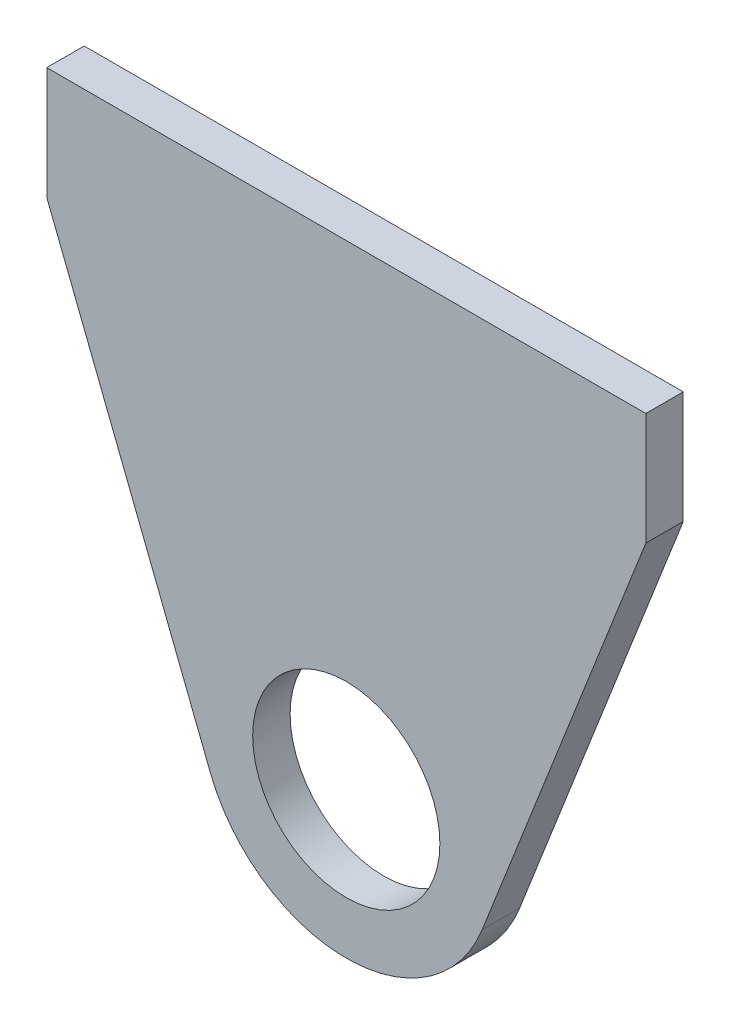
ISO-10303-21;
HEADER;
FILE_DESCRIPTION(('STEP AP214'),'2;1');
FILE_NAME('part.step','',(''),(''),'','','');
FILE_SCHEMA(('AUTOMOTIVE_DESIGN { 1 0 10303 214 1 1 1 1 }'));
ENDSEC;
DATA;
#1=APPLICATION_CONTEXT('core data for automotive mechanical design processes');
#2=APPLICATION_PROTOCOL_DEFINITION('international standard','automotive_design',2000,#1);
#3=PRODUCT_CONTEXT('',#1,'mechanical');
#4=PRODUCT('Part','Part','',(#3));
#5=PRODUCT_RELATED_PRODUCT_CATEGORY('part','',(#4));
#6=PRODUCT_DEFINITION_FORMATION('','',#4);
#7=PRODUCT_DEFINITION_CONTEXT('part definition',#1,'design');
#8=PRODUCT_DEFINITION('design','',#6,#7);
#9=PRODUCT_DEFINITION_SHAPE('','',#8);
#10=(LENGTH_UNIT() NAMED_UNIT(*) SI_UNIT(.MILLI.,.METRE.));
#11=(NAMED_UNIT(*) PLANE_ANGLE_UNIT() SI_UNIT($,.RADIAN.));
#12=(NAMED_UNIT(*) SI_UNIT($,.STERADIAN.) SOLID_ANGLE_UNIT());
#13=UNCERTAINTY_MEASURE_WITH_UNIT(LENGTH_MEASURE(1.E-05),#10,'distance_accuracy_value','');
#14=(GEOMETRIC_REPRESENTATION_CONTEXT(3) GLOBAL_UNCERTAINTY_ASSIGNED_CONTEXT((#13)) GLOBAL_UNIT_ASSIGNED_CONTEXT((#10,
#11,#12)) REPRESENTATION_CONTEXT('',''));
#15=CARTESIAN_POINT('',(0.,0.,0.));
#16=DIRECTION('',(0.,0.,1.));
#17=DIRECTION('',(1.,0.,0.));
#18=AXIS2_PLACEMENT_3D('',#15,#16,#17);
#19=CARTESIAN_POINT('',(0.,-64.9999999999998,5.));
#20=DIRECTION('',(0.,0.,0.999999999999999));
#21=DIRECTION('',(1.,0.,0.));
#22=AXIS2_PLACEMENT_3D('',#19,#20,#21);
#23=PLANE('',#22);
#24=CARTESIAN_POINT('',(0.,-64.9999999999998,5.));
#25=DIRECTION('',(0.,0.,0.999999999999999));
#26=DIRECTION('',(1.,0.,0.));
#27=AXIS2_PLACEMENT_3D('',#24,#25,#26);
#28=CIRCLE('',#27,19.4999999999999);
#29=CARTESIAN_POINT('',(-18.1501408647938,-72.1289821565309,5.00000000000012));
#30=VERTEX_POINT('',#29);
#31=CARTESIAN_POINT('',(18.1501408647938,-72.1289821565309,5.));
#32=VERTEX_POINT('',#31);
#33=EDGE_CURVE('E130',#30,#32,#28,.T.);
#34=ORIENTED_EDGE('',*,*,#33,.T.);
#35=DIRECTION('',(0.365588828540057,0.930776454604815,0.));
#36=VECTOR('',#35,1.);
#37=CARTESIAN_POINT('',(18.1501408647938,-72.1289821565309,5.));
#38=LINE('',#37,#36);
#39=CARTESIAN_POINT('',(40.,-16.5,5.));
#40=VERTEX_POINT('',#39);
#41=EDGE_CURVE('E88',#32,#40,#38,.T.);
#42=ORIENTED_EDGE('',*,*,#41,.T.);
#43=DIRECTION('',(0.,1.,0.));
#44=VECTOR('',#43,1.);
#45=CARTESIAN_POINT('',(40.,-16.5,5.));
#46=LINE('',#45,#44);
#47=CARTESIAN_POINT('',(40.,-1.50000000000002,5.));
#48=VERTEX_POINT('',#47);
#49=EDGE_CURVE('E101',#40,#48,#46,.T.);
#50=ORIENTED_EDGE('',*,*,#49,.T.);
#51=DIRECTION('',(-1.,0.,0.));
#52=VECTOR('',#51,1.);
#53=CARTESIAN_POINT('',(-40.,-1.50000000000002,5.));
#54=LINE('',#53,#52);
#55=CARTESIAN_POINT('',(-40.,-1.50000000000002,5.));
#56=VERTEX_POINT('',#55);
#57=EDGE_CURVE('E95',#48,#56,#54,.T.);
#58=ORIENTED_EDGE('',*,*,#57,.T.);
#59=DIRECTION('',(0.,-1.,0.));
#60=VECTOR('',#59,1.);
#61=CARTESIAN_POINT('',(-40.,-16.5000000000001,5.));
#62=LINE('',#61,#60);
#63=CARTESIAN_POINT('',(-40.,-16.5000000000001,5.));
#64=VERTEX_POINT('',#63);
#65=EDGE_CURVE('E99',#56,#64,#62,.T.);
#66=ORIENTED_EDGE('',*,*,#65,.T.);
#67=DIRECTION('',(0.365588828540057,-0.930776454604815,0.));
#68=VECTOR('',#67,1.);
#69=CARTESIAN_POINT('',(-18.1501408647938,-72.1289821565309,5.00000000000012));
#70=LINE('',#69,#68);
#71=EDGE_CURVE('E51',#64,#30,#70,.T.);
#72=ORIENTED_EDGE('',*,*,#71,.T.);
#73=EDGE_LOOP('',(#34,#42,#50,#58,#66,#72));
#74=FACE_BOUND('',#73,.T.);
#75=CARTESIAN_POINT('',(0.,-64.9999999999998,5.));
#76=DIRECTION('',(0.,0.,0.999999999999999));
#77=DIRECTION('',(1.,0.,0.));
#78=AXIS2_PLACEMENT_3D('',#75,#76,#77);
#79=CIRCLE('',#78,12.5);
#80=CARTESIAN_POINT('',(12.5000000000001,-64.9999999999998,5.));
#81=VERTEX_POINT('',#80);
#82=EDGE_CURVE('E123',#81,#81,#79,.T.);
#83=ORIENTED_EDGE('',*,*,#82,.F.);
#84=EDGE_LOOP('',(#83));
#85=FACE_BOUND('',#84,.T.);
#86=ADVANCED_FACE('F34',(#74,#85),#23,.T.);
#87=CARTESIAN_POINT('',(0.,-64.9999999999998,0.));
#88=DIRECTION('',(0.,0.,0.999999999999999));
#89=DIRECTION('',(1.,0.,0.));
#90=AXIS2_PLACEMENT_3D('',#87,#88,#89);
#91=PLANE('',#90);
#92=CARTESIAN_POINT('',(0.,-64.9999999999998,0.));
#93=DIRECTION('',(0.,0.,0.999999999999999));
#94=DIRECTION('',(1.,0.,0.));
#95=AXIS2_PLACEMENT_3D('',#92,#93,#94);
#96=CIRCLE('',#95,19.4999999999999);
#97=CARTESIAN_POINT('',(-18.1501408647938,-72.1289821565309,1.66533453693773E-13));
#98=VERTEX_POINT('',#97);
#99=CARTESIAN_POINT('',(18.1501408647938,-72.1289821565309,0.));
#100=VERTEX_POINT('',#99);
#101=EDGE_CURVE('E119',#98,#100,#96,.T.);
#102=ORIENTED_EDGE('',*,*,#101,.F.);
#103=DIRECTION('',(0.365588828540057,-0.930776454604815,0.));
#104=VECTOR('',#103,1.);
#105=CARTESIAN_POINT('',(-18.1501408647938,-72.1289821565309,1.66533453693773E-13));
#106=LINE('',#105,#104);
#107=CARTESIAN_POINT('',(-40.,-16.5000000000001,0.));
#108=VERTEX_POINT('',#107);
#109=EDGE_CURVE('E80',#108,#98,#106,.T.);
#110=ORIENTED_EDGE('',*,*,#109,.F.);
#111=DIRECTION('',(0.,-1.,0.));
#112=VECTOR('',#111,1.);
#113=CARTESIAN_POINT('',(-40.,-16.5000000000001,0.));
#114=LINE('',#113,#112);
#115=CARTESIAN_POINT('',(-40.,-1.50000000000006,0.));
#116=VERTEX_POINT('',#115);
#117=EDGE_CURVE('E74',#116,#108,#114,.T.);
#118=ORIENTED_EDGE('',*,*,#117,.F.);
#119=DIRECTION('',(-1.,0.,0.));
#120=VECTOR('',#119,1.);
#121=CARTESIAN_POINT('',(-40.,-1.50000000000006,0.));
#122=LINE('',#121,#120);
#123=CARTESIAN_POINT('',(40.,-1.50000000000006,0.));
#124=VERTEX_POINT('',#123);
#125=EDGE_CURVE('E109',#124,#116,#122,.T.);
#126=ORIENTED_EDGE('',*,*,#125,.F.);
#127=DIRECTION('',(0.,1.,0.));
#128=VECTOR('',#127,1.);
#129=CARTESIAN_POINT('',(40.,-16.5,0.));
#130=LINE('',#129,#128);
#131=CARTESIAN_POINT('',(40.,-16.5,0.));
#132=VERTEX_POINT('',#131);
#133=EDGE_CURVE('E125',#132,#124,#130,.T.);
#134=ORIENTED_EDGE('',*,*,#133,.F.);
#135=DIRECTION('',(0.365588828540057,0.930776454604815,0.));
#136=VECTOR('',#135,1.);
#137=CARTESIAN_POINT('',(18.1501408647938,-72.1289821565309,0.));
#138=LINE('',#137,#136);
#139=EDGE_CURVE('E122',#100,#132,#138,.T.);
#140=ORIENTED_EDGE('',*,*,#139,.F.);
#141=EDGE_LOOP('',(#102,#110,#118,#126,#134,#140));
#142=FACE_BOUND('',#141,.T.);
#143=CARTESIAN_POINT('',(0.,-64.9999999999998,0.));
#144=DIRECTION('',(0.,0.,0.999999999999999));
#145=DIRECTION('',(1.,0.,0.));
#146=AXIS2_PLACEMENT_3D('',#143,#144,#145);
#147=CIRCLE('',#146,12.5);
#148=CARTESIAN_POINT('',(12.5000000000001,-64.9999999999998,0.));
#149=VERTEX_POINT('',#148);
#150=EDGE_CURVE('E223',#149,#149,#147,.T.);
#151=ORIENTED_EDGE('',*,*,#150,.T.);
#152=EDGE_LOOP('',(#151));
#153=FACE_BOUND('',#152,.T.);
#154=ADVANCED_FACE('F139',(#142,#153),#91,.F.);
#155=CARTESIAN_POINT('',(0.,-64.9999999999998,5.));
#156=DIRECTION('',(0.,0.,-0.999999999999999));
#157=DIRECTION('',(-1.,0.,0.));
#158=AXIS2_PLACEMENT_3D('',#155,#156,#157);
#159=CYLINDRICAL_SURFACE('',#158,19.4999999999999);
#160=ORIENTED_EDGE('',*,*,#101,.T.);
#161=DIRECTION('',(0.,0.,-0.999999999999999));
#162=VECTOR('',#161,1.);
#163=CARTESIAN_POINT('',(18.1501408647938,-72.1289821565309,5.));
#164=LINE('',#163,#162);
#165=EDGE_CURVE('E11',#32,#100,#164,.T.);
#166=ORIENTED_EDGE('',*,*,#165,.F.);
#167=ORIENTED_EDGE('',*,*,#33,.F.);
#168=DIRECTION('',(0.,0.,-0.999999999999999));
#169=VECTOR('',#168,1.);
#170=CARTESIAN_POINT('',(-18.1501408647938,-72.1289821565309,5.00000000000012));
#171=LINE('',#170,#169);
#172=EDGE_CURVE('E115',#30,#98,#171,.T.);
#173=ORIENTED_EDGE('',*,*,#172,.T.);
#174=EDGE_LOOP('',(#160,#166,#167,#173));
#175=FACE_BOUND('',#174,.T.);
#176=ADVANCED_FACE('F36',(#175),#159,.T.);
#177=CARTESIAN_POINT('',(18.1501408647938,-72.1289821565309,5.));
#178=DIRECTION('',(-0.930776454604815,0.365588828540057,0.));
#179=DIRECTION('',(-0.365588828540057,-0.930776454604815,0.));
#180=AXIS2_PLACEMENT_3D('',#177,#178,#179);
#181=PLANE('',#180);
#182=ORIENTED_EDGE('',*,*,#139,.T.);
#183=DIRECTION('',(0.,0.,-0.999999999999999));
#184=VECTOR('',#183,1.);
#185=CARTESIAN_POINT('',(40.,-16.5,5.));
#186=LINE('',#185,#184);
#187=EDGE_CURVE('E43',#40,#132,#186,.T.);
#188=ORIENTED_EDGE('',*,*,#187,.F.);
#189=ORIENTED_EDGE('',*,*,#41,.F.);
#190=ORIENTED_EDGE('',*,*,#165,.T.);
#191=EDGE_LOOP('',(#182,#188,#189,#190));
#192=FACE_BOUND('',#191,.T.);
#193=ADVANCED_FACE('F164',(#192),#181,.F.);
#194=CARTESIAN_POINT('',(40.,-16.5,5.));
#195=DIRECTION('',(-1.,0.,0.));
#196=DIRECTION('',(0.,0.,0.999999999999999));
#197=AXIS2_PLACEMENT_3D('',#194,#195,#196);
#198=PLANE('',#197);
#199=ORIENTED_EDGE('',*,*,#133,.T.);
#200=DIRECTION('',(0.,0.,-0.999999999999999));
#201=VECTOR('',#200,1.);
#202=CARTESIAN_POINT('',(40.,-1.50000000000002,5.));
#203=LINE('',#202,#201);
#204=EDGE_CURVE('E110',#48,#124,#203,.T.);
#205=ORIENTED_EDGE('',*,*,#204,.F.);
#206=ORIENTED_EDGE('',*,*,#49,.F.);
#207=ORIENTED_EDGE('',*,*,#187,.T.);
#208=EDGE_LOOP('',(#199,#205,#206,#207));
#209=FACE_BOUND('',#208,.T.);
#210=ADVANCED_FACE('F136',(#209),#198,.F.);
#211=CARTESIAN_POINT('',(-40.,-1.50000000000002,5.));
#212=DIRECTION('',(0.,-1.,0.));
#213=DIRECTION('',(0.,0.,-0.999999999999999));
#214=AXIS2_PLACEMENT_3D('',#211,#212,#213);
#215=PLANE('',#214);
#216=ORIENTED_EDGE('',*,*,#125,.T.);
#217=DIRECTION('',(0.,0.,-0.999999999999999));
#218=VECTOR('',#217,1.);
#219=CARTESIAN_POINT('',(-40.,-1.50000000000002,5.));
#220=LINE('',#219,#218);
#221=EDGE_CURVE('E106',#56,#116,#220,.T.);
#222=ORIENTED_EDGE('',*,*,#221,.F.);
#223=ORIENTED_EDGE('',*,*,#57,.F.);
#224=ORIENTED_EDGE('',*,*,#204,.T.);
#225=EDGE_LOOP('',(#216,#222,#223,#224));
#226=FACE_BOUND('',#225,.T.);
#227=ADVANCED_FACE('F107',(#226),#215,.F.);
#228=CARTESIAN_POINT('',(-40.,-16.5000000000001,5.));
#229=DIRECTION('',(1.,0.,0.));
#230=DIRECTION('',(0.,0.,-0.999999999999999));
#231=AXIS2_PLACEMENT_3D('',#228,#229,#230);
#232=PLANE('',#231);
#233=ORIENTED_EDGE('',*,*,#117,.T.);
#234=DIRECTION('',(0.,0.,-0.999999999999999));
#235=VECTOR('',#234,1.);
#236=CARTESIAN_POINT('',(-40.,-16.5000000000001,5.));
#237=LINE('',#236,#235);
#238=EDGE_CURVE('E111',#64,#108,#237,.T.);
#239=ORIENTED_EDGE('',*,*,#238,.F.);
#240=ORIENTED_EDGE('',*,*,#65,.F.);
#241=ORIENTED_EDGE('',*,*,#221,.T.);
#242=EDGE_LOOP('',(#233,#239,#240,#241));
#243=FACE_BOUND('',#242,.T.);
#244=ADVANCED_FACE('F113',(#243),#232,.F.);
#245=CARTESIAN_POINT('',(-18.1501408647938,-72.1289821565309,5.00000000000012));
#246=DIRECTION('',(0.930776454604815,0.365588828540057,0.));
#247=DIRECTION('',(-0.365588828540057,0.930776454604815,0.));
#248=AXIS2_PLACEMENT_3D('',#245,#246,#247);
#249=PLANE('',#248);
#250=ORIENTED_EDGE('',*,*,#109,.T.);
#251=ORIENTED_EDGE('',*,*,#172,.F.);
#252=ORIENTED_EDGE('',*,*,#71,.F.);
#253=ORIENTED_EDGE('',*,*,#238,.T.);
#254=EDGE_LOOP('',(#250,#251,#252,#253));
#255=FACE_BOUND('',#254,.T.);
#256=ADVANCED_FACE('F144',(#255),#249,.F.);
#257=CARTESIAN_POINT('',(0.,-64.9999999999998,5.));
#258=DIRECTION('',(0.,0.,-0.999999999999999));
#259=DIRECTION('',(-1.,0.,0.));
#260=AXIS2_PLACEMENT_3D('',#257,#258,#259);
#261=CYLINDRICAL_SURFACE('',#260,12.5);
#262=ORIENTED_EDGE('',*,*,#82,.T.);
#263=EDGE_LOOP('',(#262));
#264=FACE_BOUND('',#263,.T.);
#265=ORIENTED_EDGE('',*,*,#150,.F.);
#266=EDGE_LOOP('',(#265));
#267=FACE_BOUND('',#266,.T.);
#268=ADVANCED_FACE('F146',(#264,#267),#261,.F.);
#269=CLOSED_SHELL('',(#86,#154,#176,#193,#210,#227,#244,#256,#268));
#270=MANIFOLD_SOLID_BREP('B2',#269);
#271=ADVANCED_BREP_SHAPE_REPRESENTATION('',(#18,#270),#14);
#272=SHAPE_DEFINITION_REPRESENTATION(#9,#271);
ENDSEC;
END-ISO-10303-21;
